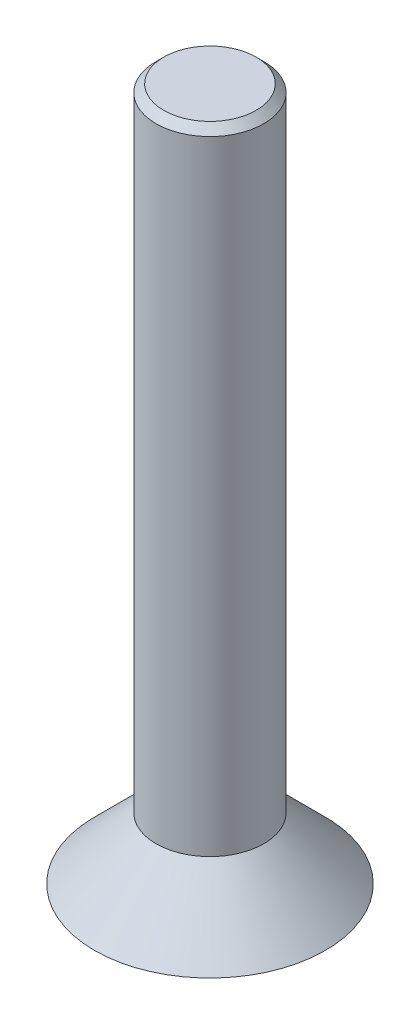
ISO-10303-21;
HEADER;
FILE_DESCRIPTION(('STEP AP214'),'2;1');
FILE_NAME('part.step','',(''),(''),'','','');
FILE_SCHEMA(('AUTOMOTIVE_DESIGN { 1 0 10303 214 1 1 1 1 }'));
ENDSEC;
DATA;
#1=APPLICATION_CONTEXT('core data for automotive mechanical design processes');
#2=APPLICATION_PROTOCOL_DEFINITION('international standard','automotive_design',2000,#1);
#3=PRODUCT_CONTEXT('',#1,'mechanical');
#4=PRODUCT('Part','Part','',(#3));
#5=PRODUCT_RELATED_PRODUCT_CATEGORY('part','',(#4));
#6=PRODUCT_DEFINITION_FORMATION('','',#4);
#7=PRODUCT_DEFINITION_CONTEXT('part definition',#1,'design');
#8=PRODUCT_DEFINITION('design','',#6,#7);
#9=PRODUCT_DEFINITION_SHAPE('','',#8);
#10=(LENGTH_UNIT() NAMED_UNIT(*) SI_UNIT(.MILLI.,.METRE.));
#11=(NAMED_UNIT(*) PLANE_ANGLE_UNIT() SI_UNIT($,.RADIAN.));
#12=(NAMED_UNIT(*) SI_UNIT($,.STERADIAN.) SOLID_ANGLE_UNIT());
#13=UNCERTAINTY_MEASURE_WITH_UNIT(LENGTH_MEASURE(1.E-05),#10,'distance_accuracy_value','');
#14=(GEOMETRIC_REPRESENTATION_CONTEXT(3) GLOBAL_UNCERTAINTY_ASSIGNED_CONTEXT((#13)) GLOBAL_UNIT_ASSIGNED_CONTEXT((#10,
#11,#12)) REPRESENTATION_CONTEXT('',''));
#15=CARTESIAN_POINT('',(0.,0.,0.));
#16=DIRECTION('',(0.,0.,1.));
#17=DIRECTION('',(1.,0.,0.));
#18=AXIS2_PLACEMENT_3D('',#15,#16,#17);
#19=CARTESIAN_POINT('',(0.,0.,0.));
#20=DIRECTION('',(0.,1.,0.));
#21=DIRECTION('',(0.,0.,1.));
#22=AXIS2_PLACEMENT_3D('',#19,#20,#21);
#23=PLANE('',#22);
#24=CARTESIAN_POINT('',(0.,0.,0.));
#25=DIRECTION('',(0.,1.,0.));
#26=DIRECTION('',(0.,0.,1.));
#27=AXIS2_PLACEMENT_3D('',#24,#25,#26);
#28=CIRCLE('',#27,3.);
#29=CARTESIAN_POINT('',(0.,0.,3.));
#30=VERTEX_POINT('',#29);
#31=EDGE_CURVE('E125',#30,#30,#28,.T.);
#32=ORIENTED_EDGE('',*,*,#31,.F.);
#33=EDGE_LOOP('',(#32));
#34=FACE_BOUND('',#33,.T.);
#35=DIRECTION('',(0.866025403784439,0.,0.5));
#36=VECTOR('',#35,1.);
#37=CARTESIAN_POINT('',(-1.,0.,0.577350269189626));
#38=LINE('',#37,#36);
#39=CARTESIAN_POINT('',(-1.,0.,0.577350269189626));
#40=VERTEX_POINT('',#39);
#41=CARTESIAN_POINT('',(0.,0.,1.15470053837925));
#42=VERTEX_POINT('',#41);
#43=EDGE_CURVE('E54',#40,#42,#38,.T.);
#44=ORIENTED_EDGE('',*,*,#43,.T.);
#45=DIRECTION('',(0.866025403784438,0.,-0.5));
#46=VECTOR('',#45,1.);
#47=CARTESIAN_POINT('',(0.,0.,1.15470053837925));
#48=LINE('',#47,#46);
#49=CARTESIAN_POINT('',(1.,0.,0.577350269189626));
#50=VERTEX_POINT('',#49);
#51=EDGE_CURVE('E110',#42,#50,#48,.T.);
#52=ORIENTED_EDGE('',*,*,#51,.T.);
#53=DIRECTION('',(0.,0.,-1.));
#54=VECTOR('',#53,1.);
#55=CARTESIAN_POINT('',(1.,0.,0.577350269189626));
#56=LINE('',#55,#54);
#57=CARTESIAN_POINT('',(0.999999999999999,0.,-0.577350269189626));
#58=VERTEX_POINT('',#57);
#59=EDGE_CURVE('E108',#50,#58,#56,.T.);
#60=ORIENTED_EDGE('',*,*,#59,.T.);
#61=DIRECTION('',(-0.866025403784439,0.,-0.5));
#62=VECTOR('',#61,1.);
#63=CARTESIAN_POINT('',(0.999999999999999,0.,-0.577350269189626));
#64=LINE('',#63,#62);
#65=CARTESIAN_POINT('',(0.,0.,-1.15470053837925));
#66=VERTEX_POINT('',#65);
#67=EDGE_CURVE('E89',#58,#66,#64,.T.);
#68=ORIENTED_EDGE('',*,*,#67,.T.);
#69=DIRECTION('',(-0.866025403784438,0.,0.5));
#70=VECTOR('',#69,1.);
#71=CARTESIAN_POINT('',(0.,0.,-1.15470053837925));
#72=LINE('',#71,#70);
#73=CARTESIAN_POINT('',(-1.,0.,-0.577350269189625));
#74=VERTEX_POINT('',#73);
#75=EDGE_CURVE('E98',#66,#74,#72,.T.);
#76=ORIENTED_EDGE('',*,*,#75,.T.);
#77=DIRECTION('',(0.,0.,1.));
#78=VECTOR('',#77,1.);
#79=CARTESIAN_POINT('',(-1.,0.,-0.577350269189625));
#80=LINE('',#79,#78);
#81=EDGE_CURVE('E104',#74,#40,#80,.T.);
#82=ORIENTED_EDGE('',*,*,#81,.T.);
#83=EDGE_LOOP('',(#44,#52,#60,#68,#76,#82));
#84=FACE_BOUND('',#83,.T.);
#85=ADVANCED_FACE('F38',(#34,#84),#23,.F.);
#86=CARTESIAN_POINT('',(-1.,1.6,0.577350269189626));
#87=DIRECTION('',(0.5,0.,-0.866025403784439));
#88=DIRECTION('',(-0.866025403784439,0.,-0.5));
#89=AXIS2_PLACEMENT_3D('',#86,#87,#88);
#90=PLANE('',#89);
#91=ORIENTED_EDGE('',*,*,#43,.F.);
#92=DIRECTION('',(0.,-1.,0.));
#93=VECTOR('',#92,1.);
#94=CARTESIAN_POINT('',(-1.,1.6,0.577350269189626));
#95=LINE('',#94,#93);
#96=CARTESIAN_POINT('',(-1.,1.6,0.577350269189626));
#97=VERTEX_POINT('',#96);
#98=EDGE_CURVE('E116',#97,#40,#95,.T.);
#99=ORIENTED_EDGE('',*,*,#98,.F.);
#100=DIRECTION('',(0.866025403784439,0.,0.5));
#101=VECTOR('',#100,1.);
#102=CARTESIAN_POINT('',(-1.,1.6,0.577350269189626));
#103=LINE('',#102,#101);
#104=CARTESIAN_POINT('',(0.,1.6,1.15470053837925));
#105=VERTEX_POINT('',#104);
#106=EDGE_CURVE('E115',#97,#105,#103,.T.);
#107=ORIENTED_EDGE('',*,*,#106,.T.);
#108=DIRECTION('',(0.,-1.,0.));
#109=VECTOR('',#108,1.);
#110=CARTESIAN_POINT('',(0.,1.6,1.15470053837925));
#111=LINE('',#110,#109);
#112=EDGE_CURVE('E123',#105,#42,#111,.T.);
#113=ORIENTED_EDGE('',*,*,#112,.T.);
#114=EDGE_LOOP('',(#91,#99,#107,#113));
#115=FACE_BOUND('',#114,.T.);
#116=ADVANCED_FACE('F144',(#115),#90,.T.);
#117=CARTESIAN_POINT('',(0.,1.6,1.15470053837925));
#118=DIRECTION('',(-0.5,0.,-0.866025403784438));
#119=DIRECTION('',(-0.866025403784439,0.,0.5));
#120=AXIS2_PLACEMENT_3D('',#117,#118,#119);
#121=PLANE('',#120);
#122=ORIENTED_EDGE('',*,*,#51,.F.);
#123=ORIENTED_EDGE('',*,*,#112,.F.);
#124=DIRECTION('',(0.866025403784438,0.,-0.5));
#125=VECTOR('',#124,1.);
#126=CARTESIAN_POINT('',(0.,1.6,1.15470053837925));
#127=LINE('',#126,#125);
#128=CARTESIAN_POINT('',(1.,1.6,0.577350269189626));
#129=VERTEX_POINT('',#128);
#130=EDGE_CURVE('E203',#105,#129,#127,.T.);
#131=ORIENTED_EDGE('',*,*,#130,.T.);
#132=DIRECTION('',(0.,-1.,0.));
#133=VECTOR('',#132,1.);
#134=CARTESIAN_POINT('',(1.,1.6,0.577350269189626));
#135=LINE('',#134,#133);
#136=EDGE_CURVE('E121',#129,#50,#135,.T.);
#137=ORIENTED_EDGE('',*,*,#136,.T.);
#138=EDGE_LOOP('',(#122,#123,#131,#137));
#139=FACE_BOUND('',#138,.T.);
#140=ADVANCED_FACE('F150',(#139),#121,.T.);
#141=CARTESIAN_POINT('',(1.,1.6,0.577350269189626));
#142=DIRECTION('',(-1.,0.,0.));
#143=DIRECTION('',(0.,0.,1.));
#144=AXIS2_PLACEMENT_3D('',#141,#142,#143);
#145=PLANE('',#144);
#146=ORIENTED_EDGE('',*,*,#59,.F.);
#147=ORIENTED_EDGE('',*,*,#136,.F.);
#148=DIRECTION('',(0.,0.,-1.));
#149=VECTOR('',#148,1.);
#150=CARTESIAN_POINT('',(1.,1.6,0.577350269189626));
#151=LINE('',#150,#149);
#152=CARTESIAN_POINT('',(0.999999999999999,1.6,-0.577350269189626));
#153=VERTEX_POINT('',#152);
#154=EDGE_CURVE('E201',#129,#153,#151,.T.);
#155=ORIENTED_EDGE('',*,*,#154,.T.);
#156=DIRECTION('',(0.,-1.,0.));
#157=VECTOR('',#156,1.);
#158=CARTESIAN_POINT('',(0.999999999999999,1.6,-0.577350269189626));
#159=LINE('',#158,#157);
#160=EDGE_CURVE('E94',#153,#58,#159,.T.);
#161=ORIENTED_EDGE('',*,*,#160,.T.);
#162=EDGE_LOOP('',(#146,#147,#155,#161));
#163=FACE_BOUND('',#162,.T.);
#164=ADVANCED_FACE('F182',(#163),#145,.T.);
#165=CARTESIAN_POINT('',(0.999999999999999,1.6,-0.577350269189626));
#166=DIRECTION('',(-0.5,0.,0.866025403784439));
#167=DIRECTION('',(0.866025403784439,0.,0.5));
#168=AXIS2_PLACEMENT_3D('',#165,#166,#167);
#169=PLANE('',#168);
#170=ORIENTED_EDGE('',*,*,#67,.F.);
#171=ORIENTED_EDGE('',*,*,#160,.F.);
#172=DIRECTION('',(-0.866025403784439,0.,-0.5));
#173=VECTOR('',#172,1.);
#174=CARTESIAN_POINT('',(0.999999999999999,1.6,-0.577350269189626));
#175=LINE('',#174,#173);
#176=CARTESIAN_POINT('',(0.,1.6,-1.15470053837925));
#177=VERTEX_POINT('',#176);
#178=EDGE_CURVE('E63',#153,#177,#175,.T.);
#179=ORIENTED_EDGE('',*,*,#178,.T.);
#180=DIRECTION('',(0.,-1.,0.));
#181=VECTOR('',#180,1.);
#182=CARTESIAN_POINT('',(0.,1.6,-1.15470053837925));
#183=LINE('',#182,#181);
#184=EDGE_CURVE('E84',#177,#66,#183,.T.);
#185=ORIENTED_EDGE('',*,*,#184,.T.);
#186=EDGE_LOOP('',(#170,#171,#179,#185));
#187=FACE_BOUND('',#186,.T.);
#188=ADVANCED_FACE('F86',(#187),#169,.T.);
#189=CARTESIAN_POINT('',(0.,1.6,-1.15470053837925));
#190=DIRECTION('',(0.5,0.,0.866025403784438));
#191=DIRECTION('',(0.866025403784439,0.,-0.5));
#192=AXIS2_PLACEMENT_3D('',#189,#190,#191);
#193=PLANE('',#192);
#194=ORIENTED_EDGE('',*,*,#75,.F.);
#195=ORIENTED_EDGE('',*,*,#184,.F.);
#196=DIRECTION('',(-0.866025403784438,0.,0.5));
#197=VECTOR('',#196,1.);
#198=CARTESIAN_POINT('',(0.,1.6,-1.15470053837925));
#199=LINE('',#198,#197);
#200=CARTESIAN_POINT('',(-1.,1.6,-0.577350269189625));
#201=VERTEX_POINT('',#200);
#202=EDGE_CURVE('E198',#177,#201,#199,.T.);
#203=ORIENTED_EDGE('',*,*,#202,.T.);
#204=DIRECTION('',(0.,-1.,0.));
#205=VECTOR('',#204,1.);
#206=CARTESIAN_POINT('',(-1.,1.6,-0.577350269189625));
#207=LINE('',#206,#205);
#208=EDGE_CURVE('E95',#201,#74,#207,.T.);
#209=ORIENTED_EDGE('',*,*,#208,.T.);
#210=EDGE_LOOP('',(#194,#195,#203,#209));
#211=FACE_BOUND('',#210,.T.);
#212=ADVANCED_FACE('F99',(#211),#193,.T.);
#213=CARTESIAN_POINT('',(-1.,1.6,-0.577350269189625));
#214=DIRECTION('',(1.,0.,0.));
#215=DIRECTION('',(0.,0.,-1.));
#216=AXIS2_PLACEMENT_3D('',#213,#214,#215);
#217=PLANE('',#216);
#218=ORIENTED_EDGE('',*,*,#81,.F.);
#219=ORIENTED_EDGE('',*,*,#208,.F.);
#220=DIRECTION('',(0.,0.,1.));
#221=VECTOR('',#220,1.);
#222=CARTESIAN_POINT('',(-1.,1.6,-0.577350269189625));
#223=LINE('',#222,#221);
#224=EDGE_CURVE('E118',#201,#97,#223,.T.);
#225=ORIENTED_EDGE('',*,*,#224,.T.);
#226=ORIENTED_EDGE('',*,*,#98,.T.);
#227=EDGE_LOOP('',(#218,#219,#225,#226));
#228=FACE_BOUND('',#227,.T.);
#229=ADVANCED_FACE('F160',(#228),#217,.T.);
#230=CARTESIAN_POINT('',(0.,1.6,0.));
#231=DIRECTION('',(0.,-1.,0.));
#232=DIRECTION('',(0.,0.,-1.));
#233=AXIS2_PLACEMENT_3D('',#230,#231,#232);
#234=CONICAL_SURFACE('',#233,1.4,0.785398163397447);
#235=ORIENTED_EDGE('',*,*,#31,.T.);
#236=EDGE_LOOP('',(#235));
#237=FACE_BOUND('',#236,.T.);
#238=CARTESIAN_POINT('',(0.,1.6,0.));
#239=DIRECTION('',(0.,1.,0.));
#240=DIRECTION('',(0.,0.,1.));
#241=AXIS2_PLACEMENT_3D('',#238,#239,#240);
#242=CIRCLE('',#241,1.4);
#243=CARTESIAN_POINT('',(0.,1.6,1.4));
#244=VERTEX_POINT('',#243);
#245=EDGE_CURVE('E128',#244,#244,#242,.T.);
#246=ORIENTED_EDGE('',*,*,#245,.F.);
#247=EDGE_LOOP('',(#246));
#248=FACE_BOUND('',#247,.T.);
#249=ADVANCED_FACE('F155',(#237,#248),#234,.T.);
#250=CARTESIAN_POINT('',(0.,1.6,0.));
#251=DIRECTION('',(0.,1.,0.));
#252=DIRECTION('',(0.,0.,1.));
#253=AXIS2_PLACEMENT_3D('',#250,#251,#252);
#254=PLANE('',#253);
#255=ORIENTED_EDGE('',*,*,#130,.F.);
#256=ORIENTED_EDGE('',*,*,#106,.F.);
#257=ORIENTED_EDGE('',*,*,#224,.F.);
#258=ORIENTED_EDGE('',*,*,#202,.F.);
#259=ORIENTED_EDGE('',*,*,#178,.F.);
#260=ORIENTED_EDGE('',*,*,#154,.F.);
#261=EDGE_LOOP('',(#255,#256,#257,#258,#259,#260));
#262=FACE_BOUND('',#261,.T.);
#263=ADVANCED_FACE('F159',(#262),#254,.F.);
#264=CARTESIAN_POINT('',(0.,18.,0.));
#265=DIRECTION('',(0.,-1.,0.));
#266=DIRECTION('',(0.,0.,-1.));
#267=AXIS2_PLACEMENT_3D('',#264,#265,#266);
#268=CYLINDRICAL_SURFACE('',#267,1.4);
#269=CARTESIAN_POINT('',(0.,17.8,0.));
#270=DIRECTION('',(0.,1.,0.));
#271=DIRECTION('',(0.,0.,1.));
#272=AXIS2_PLACEMENT_3D('',#269,#270,#271);
#273=CIRCLE('',#272,1.4);
#274=CARTESIAN_POINT('',(0.,17.8,1.4));
#275=VERTEX_POINT('',#274);
#276=EDGE_CURVE('E11',#275,#275,#273,.F.);
#277=ORIENTED_EDGE('',*,*,#276,.T.);
#278=EDGE_LOOP('',(#277));
#279=FACE_BOUND('',#278,.T.);
#280=ORIENTED_EDGE('',*,*,#245,.T.);
#281=EDGE_LOOP('',(#280));
#282=FACE_BOUND('',#281,.T.);
#283=ADVANCED_FACE('F140',(#279,#282),#268,.T.);
#284=CARTESIAN_POINT('',(0.,18.,0.));
#285=DIRECTION('',(0.,1.,0.));
#286=DIRECTION('',(0.,0.,1.));
#287=AXIS2_PLACEMENT_3D('',#284,#285,#286);
#288=PLANE('',#287);
#289=CARTESIAN_POINT('',(0.,18.,0.));
#290=DIRECTION('',(0.,1.,0.));
#291=DIRECTION('',(0.,0.,1.));
#292=AXIS2_PLACEMENT_3D('',#289,#290,#291);
#293=CIRCLE('',#292,1.2);
#294=CARTESIAN_POINT('',(0.,18.,1.2));
#295=VERTEX_POINT('',#294);
#296=EDGE_CURVE('E47',#295,#295,#293,.T.);
#297=ORIENTED_EDGE('',*,*,#296,.T.);
#298=EDGE_LOOP('',(#297));
#299=FACE_BOUND('',#298,.T.);
#300=ADVANCED_FACE('F133',(#299),#288,.T.);
#301=CARTESIAN_POINT('',(0.,18.,0.));
#302=DIRECTION('',(0.,-1.,0.));
#303=DIRECTION('',(0.,0.,-1.));
#304=AXIS2_PLACEMENT_3D('',#301,#302,#303);
#305=CONICAL_SURFACE('',#304,1.2,0.785398163397448);
#306=ORIENTED_EDGE('',*,*,#276,.F.);
#307=EDGE_LOOP('',(#306));
#308=FACE_BOUND('',#307,.T.);
#309=ORIENTED_EDGE('',*,*,#296,.F.);
#310=EDGE_LOOP('',(#309));
#311=FACE_BOUND('',#310,.T.);
#312=ADVANCED_FACE('F41',(#308,#311),#305,.T.);
#313=CLOSED_SHELL('',(#85,#116,#140,#164,#188,#212,#229,#249,#263,#283,#300,#312));
#314=MANIFOLD_SOLID_BREP('B2',#313);
#315=ADVANCED_BREP_SHAPE_REPRESENTATION('',(#18,#314),#14);
#316=SHAPE_DEFINITION_REPRESENTATION(#9,#315);
ENDSEC;
END-ISO-10303-21;
